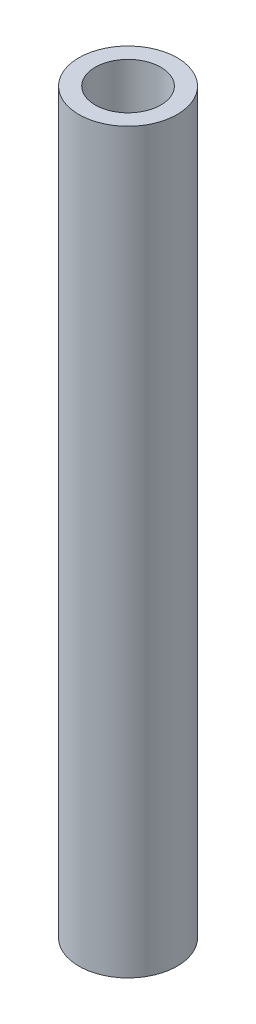
ISO-10303-21;
HEADER;
FILE_DESCRIPTION(('STEP AP214'),'2;1');
FILE_NAME('part.step','',(''),(''),'','','');
FILE_SCHEMA(('AUTOMOTIVE_DESIGN { 1 0 10303 214 1 1 1 1 }'));
ENDSEC;
DATA;
#1=APPLICATION_CONTEXT('core data for automotive mechanical design processes');
#2=APPLICATION_PROTOCOL_DEFINITION('international standard','automotive_design',2000,#1);
#3=PRODUCT_CONTEXT('',#1,'mechanical');
#4=PRODUCT('Part','Part','',(#3));
#5=PRODUCT_RELATED_PRODUCT_CATEGORY('part','',(#4));
#6=PRODUCT_DEFINITION_FORMATION('','',#4);
#7=PRODUCT_DEFINITION_CONTEXT('part definition',#1,'design');
#8=PRODUCT_DEFINITION('design','',#6,#7);
#9=PRODUCT_DEFINITION_SHAPE('','',#8);
#10=(LENGTH_UNIT() NAMED_UNIT(*) SI_UNIT(.MILLI.,.METRE.));
#11=(NAMED_UNIT(*) PLANE_ANGLE_UNIT() SI_UNIT($,.RADIAN.));
#12=(NAMED_UNIT(*) SI_UNIT($,.STERADIAN.) SOLID_ANGLE_UNIT());
#13=UNCERTAINTY_MEASURE_WITH_UNIT(LENGTH_MEASURE(1.E-05),#10,'distance_accuracy_value','');
#14=(GEOMETRIC_REPRESENTATION_CONTEXT(3) GLOBAL_UNCERTAINTY_ASSIGNED_CONTEXT((#13)) GLOBAL_UNIT_ASSIGNED_CONTEXT((#10,
#11,#12)) REPRESENTATION_CONTEXT('',''));
#15=CARTESIAN_POINT('',(0.,0.,0.));
#16=DIRECTION('',(0.,0.,1.));
#17=DIRECTION('',(1.,0.,0.));
#18=AXIS2_PLACEMENT_3D('',#15,#16,#17);
#19=CARTESIAN_POINT('',(0.,0.,0.));
#20=DIRECTION('',(0.,-1.,0.));
#21=DIRECTION('',(0.,0.,-1.));
#22=AXIS2_PLACEMENT_3D('',#19,#20,#21);
#23=PLANE('',#22);
#24=CARTESIAN_POINT('',(0.,0.,0.));
#25=DIRECTION('',(0.,-1.,0.));
#26=DIRECTION('',(0.,0.,-1.));
#27=AXIS2_PLACEMENT_3D('',#24,#25,#26);
#28=CIRCLE('',#27,20.);
#29=CARTESIAN_POINT('',(0.,0.,-20.));
#30=VERTEX_POINT('',#29);
#31=EDGE_CURVE('E52',#30,#30,#28,.T.);
#32=ORIENTED_EDGE('',*,*,#31,.T.);
#33=EDGE_LOOP('',(#32));
#34=FACE_BOUND('',#33,.T.);
#35=CARTESIAN_POINT('',(0.,0.,0.));
#36=DIRECTION('',(0.,-1.,0.));
#37=DIRECTION('',(0.,0.,-1.));
#38=AXIS2_PLACEMENT_3D('',#35,#36,#37);
#39=CIRCLE('',#38,30.);
#40=CARTESIAN_POINT('',(0.,0.,-30.));
#41=VERTEX_POINT('',#40);
#42=EDGE_CURVE('E44',#41,#41,#39,.T.);
#43=ORIENTED_EDGE('',*,*,#42,.F.);
#44=EDGE_LOOP('',(#43));
#45=FACE_BOUND('',#44,.T.);
#46=ADVANCED_FACE('F38',(#34,#45),#23,.F.);
#47=CARTESIAN_POINT('',(0.,-450.,0.));
#48=DIRECTION('',(0.,-1.,0.));
#49=DIRECTION('',(0.,0.,-1.));
#50=AXIS2_PLACEMENT_3D('',#47,#48,#49);
#51=PLANE('',#50);
#52=CARTESIAN_POINT('',(0.,-450.,0.));
#53=DIRECTION('',(0.,-1.,0.));
#54=DIRECTION('',(0.,0.,-1.));
#55=AXIS2_PLACEMENT_3D('',#52,#53,#54);
#56=CIRCLE('',#55,20.);
#57=CARTESIAN_POINT('',(0.,-450.,-20.0000000000001));
#58=VERTEX_POINT('',#57);
#59=EDGE_CURVE('E48',#58,#58,#56,.T.);
#60=ORIENTED_EDGE('',*,*,#59,.F.);
#61=EDGE_LOOP('',(#60));
#62=FACE_BOUND('',#61,.T.);
#63=CARTESIAN_POINT('',(0.,-450.,0.));
#64=DIRECTION('',(0.,-1.,0.));
#65=DIRECTION('',(0.,0.,-1.));
#66=AXIS2_PLACEMENT_3D('',#63,#64,#65);
#67=CIRCLE('',#66,30.);
#68=CARTESIAN_POINT('',(0.,-450.,-30.0000000000001));
#69=VERTEX_POINT('',#68);
#70=EDGE_CURVE('E11',#69,#69,#67,.T.);
#71=ORIENTED_EDGE('',*,*,#70,.T.);
#72=EDGE_LOOP('',(#71));
#73=FACE_BOUND('',#72,.T.);
#74=ADVANCED_FACE('F68',(#62,#73),#51,.T.);
#75=CARTESIAN_POINT('',(0.,0.,0.));
#76=DIRECTION('',(0.,-1.,0.));
#77=DIRECTION('',(0.,0.,-1.));
#78=AXIS2_PLACEMENT_3D('',#75,#76,#77);
#79=CYLINDRICAL_SURFACE('',#78,30.);
#80=ORIENTED_EDGE('',*,*,#70,.F.);
#81=EDGE_LOOP('',(#80));
#82=FACE_BOUND('',#81,.T.);
#83=ORIENTED_EDGE('',*,*,#42,.T.);
#84=EDGE_LOOP('',(#83));
#85=FACE_BOUND('',#84,.T.);
#86=ADVANCED_FACE('F62',(#82,#85),#79,.T.);
#87=CARTESIAN_POINT('',(0.,0.,0.));
#88=DIRECTION('',(0.,-1.,0.));
#89=DIRECTION('',(0.,0.,-1.));
#90=AXIS2_PLACEMENT_3D('',#87,#88,#89);
#91=CYLINDRICAL_SURFACE('',#90,20.);
#92=ORIENTED_EDGE('',*,*,#59,.T.);
#93=EDGE_LOOP('',(#92));
#94=FACE_BOUND('',#93,.T.);
#95=ORIENTED_EDGE('',*,*,#31,.F.);
#96=EDGE_LOOP('',(#95));
#97=FACE_BOUND('',#96,.T.);
#98=ADVANCED_FACE('F60',(#94,#97),#91,.F.);
#99=CLOSED_SHELL('',(#46,#74,#86,#98));
#100=MANIFOLD_SOLID_BREP('B2',#99);
#101=ADVANCED_BREP_SHAPE_REPRESENTATION('',(#18,#100),#14);
#102=SHAPE_DEFINITION_REPRESENTATION(#9,#101);
ENDSEC;
END-ISO-10303-21;
